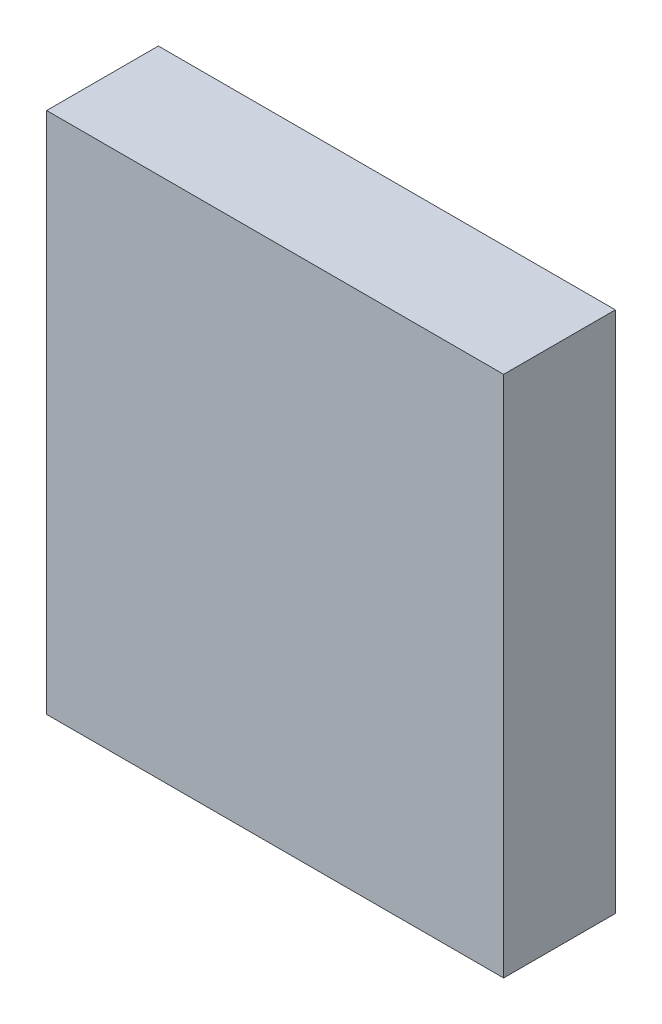
ISO-10303-21;
HEADER;
FILE_DESCRIPTION(('STEP AP214'),'2;1');
FILE_NAME('part.step','',(''),(''),'','','');
FILE_SCHEMA(('AUTOMOTIVE_DESIGN { 1 0 10303 214 1 1 1 1 }'));
ENDSEC;
DATA;
#1=APPLICATION_CONTEXT('core data for automotive mechanical design processes');
#2=APPLICATION_PROTOCOL_DEFINITION('international standard','automotive_design',2000,#1);
#3=PRODUCT_CONTEXT('',#1,'mechanical');
#4=PRODUCT('Part','Part','',(#3));
#5=PRODUCT_RELATED_PRODUCT_CATEGORY('part','',(#4));
#6=PRODUCT_DEFINITION_FORMATION('','',#4);
#7=PRODUCT_DEFINITION_CONTEXT('part definition',#1,'design');
#8=PRODUCT_DEFINITION('design','',#6,#7);
#9=PRODUCT_DEFINITION_SHAPE('','',#8);
#10=(LENGTH_UNIT() NAMED_UNIT(*) SI_UNIT(.MILLI.,.METRE.));
#11=(NAMED_UNIT(*) PLANE_ANGLE_UNIT() SI_UNIT($,.RADIAN.));
#12=(NAMED_UNIT(*) SI_UNIT($,.STERADIAN.) SOLID_ANGLE_UNIT());
#13=UNCERTAINTY_MEASURE_WITH_UNIT(LENGTH_MEASURE(1.E-05),#10,'distance_accuracy_value','');
#14=(GEOMETRIC_REPRESENTATION_CONTEXT(3) GLOBAL_UNCERTAINTY_ASSIGNED_CONTEXT((#13)) GLOBAL_UNIT_ASSIGNED_CONTEXT((#10,
#11,#12)) REPRESENTATION_CONTEXT('',''));
#15=CARTESIAN_POINT('',(0.,0.,0.));
#16=DIRECTION('',(0.,0.,1.));
#17=DIRECTION('',(1.,0.,0.));
#18=AXIS2_PLACEMENT_3D('',#15,#16,#17);
#19=CARTESIAN_POINT('',(-2.24999804,-2.5750012,1.10000034));
#20=DIRECTION('',(0.,0.,1.));
#21=DIRECTION('',(1.,0.,0.));
#22=AXIS2_PLACEMENT_3D('',#19,#20,#21);
#23=PLANE('',#22);
#24=DIRECTION('',(1.,0.,0.));
#25=VECTOR('',#24,1.);
#26=CARTESIAN_POINT('',(-2.24999804,2.5750012,1.10000034));
#27=LINE('',#26,#25);
#28=CARTESIAN_POINT('',(-2.24999804,2.5750012,1.10000034));
#29=VERTEX_POINT('',#28);
#30=CARTESIAN_POINT('',(2.25000058,2.5750012,1.10000034));
#31=VERTEX_POINT('',#30);
#32=EDGE_CURVE('E53',#29,#31,#27,.T.);
#33=ORIENTED_EDGE('',*,*,#32,.F.);
#34=DIRECTION('',(0.,1.,0.));
#35=VECTOR('',#34,1.);
#36=CARTESIAN_POINT('',(-2.24999804,-2.5750012,1.10000034));
#37=LINE('',#36,#35);
#38=CARTESIAN_POINT('',(-2.24999804,-2.57500119999999,1.10000034));
#39=VERTEX_POINT('',#38);
#40=EDGE_CURVE('E68',#39,#29,#37,.T.);
#41=ORIENTED_EDGE('',*,*,#40,.F.);
#42=DIRECTION('',(0.999999877757898,0.00049445342451915,0.));
#43=VECTOR('',#42,1.);
#44=CARTESIAN_POINT('',(2.25000058,-2.57277616,1.10000034));
#45=LINE('',#44,#43);
#46=CARTESIAN_POINT('',(2.25000058,-2.57277616,1.10000034));
#47=VERTEX_POINT('',#46);
#48=EDGE_CURVE('E20',#47,#39,#45,.F.);
#49=ORIENTED_EDGE('',*,*,#48,.F.);
#50=DIRECTION('',(0.,1.,0.));
#51=VECTOR('',#50,1.);
#52=CARTESIAN_POINT('',(2.25000058,2.5750012,1.10000034));
#53=LINE('',#52,#51);
#54=EDGE_CURVE('E58',#31,#47,#53,.F.);
#55=ORIENTED_EDGE('',*,*,#54,.F.);
#56=EDGE_LOOP('',(#33,#41,#49,#55));
#57=FACE_BOUND('',#56,.T.);
#58=ADVANCED_FACE('F17',(#57),#23,.T.);
#59=CARTESIAN_POINT('',(2.25000058,-2.57277616,0.));
#60=DIRECTION('',(0.00049445342451915,-0.999999877757898,0.));
#61=DIRECTION('',(0.999999877757898,0.00049445342451915,0.));
#62=AXIS2_PLACEMENT_3D('',#59,#60,#61);
#63=PLANE('',#62);
#64=DIRECTION('',(0.,0.,1.));
#65=VECTOR('',#64,1.);
#66=CARTESIAN_POINT('',(-2.24999804,-2.5750012,0.));
#67=LINE('',#66,#65);
#68=CARTESIAN_POINT('',(-2.24999804,-2.57500119999999,0.));
#69=VERTEX_POINT('',#68);
#70=EDGE_CURVE('E79',#69,#39,#67,.T.);
#71=ORIENTED_EDGE('',*,*,#70,.F.);
#72=DIRECTION('',(0.999999877757898,0.000494453424522718,0.));
#73=VECTOR('',#72,1.);
#74=CARTESIAN_POINT('',(-2.24999804,-2.5750012,0.));
#75=LINE('',#74,#73);
#76=CARTESIAN_POINT('',(2.25000058,-2.57277616,0.));
#77=VERTEX_POINT('',#76);
#78=EDGE_CURVE('E74',#69,#77,#75,.T.);
#79=ORIENTED_EDGE('',*,*,#78,.T.);
#80=DIRECTION('',(0.,0.,-1.));
#81=VECTOR('',#80,1.);
#82=CARTESIAN_POINT('',(2.25000058,-2.57277616,0.));
#83=LINE('',#82,#81);
#84=EDGE_CURVE('E63',#47,#77,#83,.T.);
#85=ORIENTED_EDGE('',*,*,#84,.F.);
#86=ORIENTED_EDGE('',*,*,#48,.T.);
#87=EDGE_LOOP('',(#71,#79,#85,#86));
#88=FACE_BOUND('',#87,.T.);
#89=ADVANCED_FACE('F73',(#88),#63,.T.);
#90=CARTESIAN_POINT('',(2.25000058,2.5750012,0.));
#91=DIRECTION('',(1.,0.,0.));
#92=DIRECTION('',(0.,0.,-1.));
#93=AXIS2_PLACEMENT_3D('',#90,#91,#92);
#94=PLANE('',#93);
#95=ORIENTED_EDGE('',*,*,#84,.T.);
#96=DIRECTION('',(0.,1.,0.));
#97=VECTOR('',#96,1.);
#98=CARTESIAN_POINT('',(2.25000058,-2.5750012,0.));
#99=LINE('',#98,#97);
#100=CARTESIAN_POINT('',(2.25000058,2.5750012,0.));
#101=VERTEX_POINT('',#100);
#102=EDGE_CURVE('E84',#77,#101,#99,.T.);
#103=ORIENTED_EDGE('',*,*,#102,.T.);
#104=DIRECTION('',(0.,0.,1.));
#105=VECTOR('',#104,1.);
#106=CARTESIAN_POINT('',(2.25000058,2.5750012,0.));
#107=LINE('',#106,#105);
#108=EDGE_CURVE('E65',#31,#101,#107,.F.);
#109=ORIENTED_EDGE('',*,*,#108,.F.);
#110=ORIENTED_EDGE('',*,*,#54,.T.);
#111=EDGE_LOOP('',(#95,#103,#109,#110));
#112=FACE_BOUND('',#111,.T.);
#113=ADVANCED_FACE('F60',(#112),#94,.T.);
#114=CARTESIAN_POINT('',(-2.24999804,2.5750012,0.));
#115=DIRECTION('',(0.,1.,0.));
#116=DIRECTION('',(0.,0.,1.));
#117=AXIS2_PLACEMENT_3D('',#114,#115,#116);
#118=PLANE('',#117);
#119=ORIENTED_EDGE('',*,*,#108,.T.);
#120=DIRECTION('',(1.,0.,0.));
#121=VECTOR('',#120,1.);
#122=CARTESIAN_POINT('',(-2.24999804,2.5750012,0.));
#123=LINE('',#122,#121);
#124=CARTESIAN_POINT('',(-2.24999804,2.5750012,0.));
#125=VERTEX_POINT('',#124);
#126=EDGE_CURVE('E26',#101,#125,#123,.F.);
#127=ORIENTED_EDGE('',*,*,#126,.T.);
#128=DIRECTION('',(0.,0.,1.));
#129=VECTOR('',#128,1.);
#130=CARTESIAN_POINT('',(-2.24999804,2.5750012,0.));
#131=LINE('',#130,#129);
#132=EDGE_CURVE('E34',#29,#125,#131,.F.);
#133=ORIENTED_EDGE('',*,*,#132,.F.);
#134=ORIENTED_EDGE('',*,*,#32,.T.);
#135=EDGE_LOOP('',(#119,#127,#133,#134));
#136=FACE_BOUND('',#135,.T.);
#137=ADVANCED_FACE('F88',(#136),#118,.T.);
#138=CARTESIAN_POINT('',(-2.24999804,-2.5750012,0.));
#139=DIRECTION('',(-1.,0.,0.));
#140=DIRECTION('',(0.,0.,1.));
#141=AXIS2_PLACEMENT_3D('',#138,#139,#140);
#142=PLANE('',#141);
#143=ORIENTED_EDGE('',*,*,#132,.T.);
#144=DIRECTION('',(0.,1.,0.));
#145=VECTOR('',#144,1.);
#146=CARTESIAN_POINT('',(-2.24999804,-2.5750012,0.));
#147=LINE('',#146,#145);
#148=EDGE_CURVE('E11',#125,#69,#147,.F.);
#149=ORIENTED_EDGE('',*,*,#148,.T.);
#150=ORIENTED_EDGE('',*,*,#70,.T.);
#151=ORIENTED_EDGE('',*,*,#40,.T.);
#152=EDGE_LOOP('',(#143,#149,#150,#151));
#153=FACE_BOUND('',#152,.T.);
#154=ADVANCED_FACE('F91',(#153),#142,.T.);
#155=CARTESIAN_POINT('',(-2.24999804,-2.5750012,0.));
#156=DIRECTION('',(0.,0.,1.));
#157=DIRECTION('',(1.,0.,0.));
#158=AXIS2_PLACEMENT_3D('',#155,#156,#157);
#159=PLANE('',#158);
#160=ORIENTED_EDGE('',*,*,#126,.F.);
#161=ORIENTED_EDGE('',*,*,#102,.F.);
#162=ORIENTED_EDGE('',*,*,#78,.F.);
#163=ORIENTED_EDGE('',*,*,#148,.F.);
#164=EDGE_LOOP('',(#160,#161,#162,#163));
#165=FACE_BOUND('',#164,.T.);
#166=ADVANCED_FACE('F90',(#165),#159,.F.);
#167=CLOSED_SHELL('',(#58,#89,#113,#137,#154,#166));
#168=MANIFOLD_SOLID_BREP('B1',#167);
#169=ADVANCED_BREP_SHAPE_REPRESENTATION('',(#18,#168),#14);
#170=SHAPE_DEFINITION_REPRESENTATION(#9,#169);
ENDSEC;
END-ISO-10303-21;
